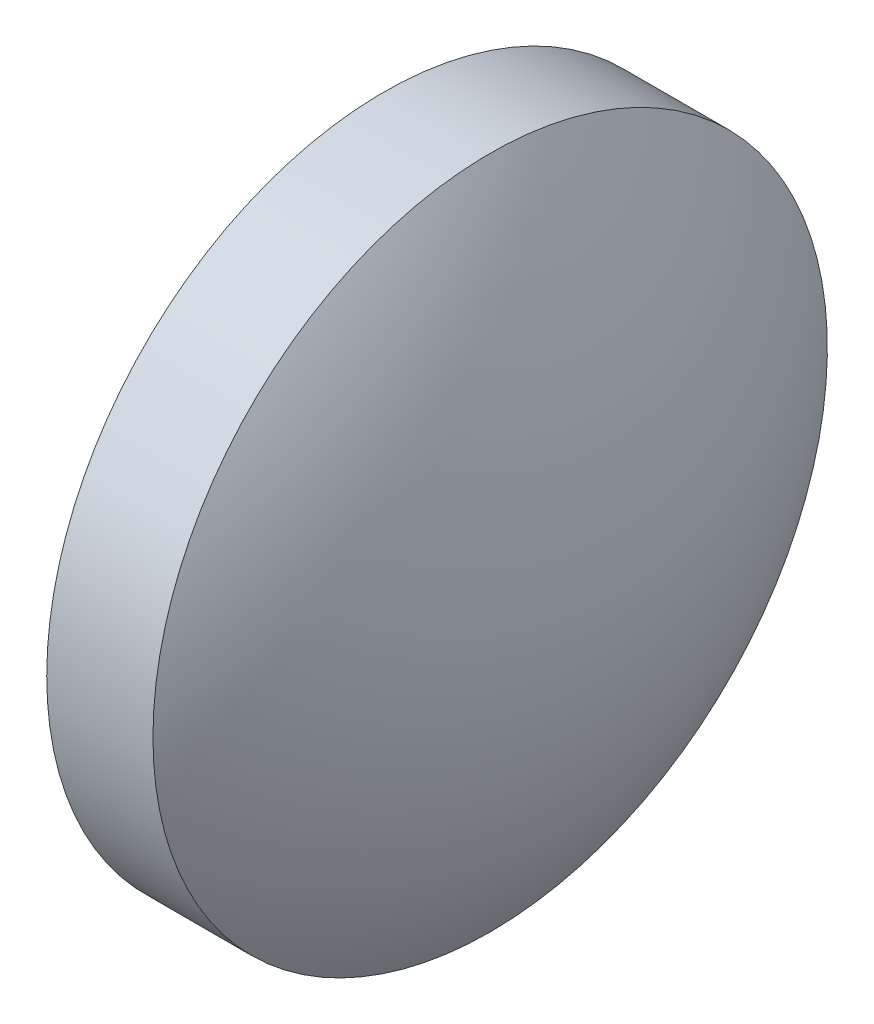
ISO-10303-21;
HEADER;
FILE_DESCRIPTION(('STEP AP214'),'2;1');
FILE_NAME('part.step','',(''),(''),'','','');
FILE_SCHEMA(('AUTOMOTIVE_DESIGN { 1 0 10303 214 1 1 1 1 }'));
ENDSEC;
DATA;
#1=APPLICATION_CONTEXT('core data for automotive mechanical design processes');
#2=APPLICATION_PROTOCOL_DEFINITION('international standard','automotive_design',2000,#1);
#3=PRODUCT_CONTEXT('',#1,'mechanical');
#4=PRODUCT('Part','Part','',(#3));
#5=PRODUCT_RELATED_PRODUCT_CATEGORY('part','',(#4));
#6=PRODUCT_DEFINITION_FORMATION('','',#4);
#7=PRODUCT_DEFINITION_CONTEXT('part definition',#1,'design');
#8=PRODUCT_DEFINITION('design','',#6,#7);
#9=PRODUCT_DEFINITION_SHAPE('','',#8);
#10=(LENGTH_UNIT() NAMED_UNIT(*) SI_UNIT(.MILLI.,.METRE.));
#11=(NAMED_UNIT(*) PLANE_ANGLE_UNIT() SI_UNIT($,.RADIAN.));
#12=(NAMED_UNIT(*) SI_UNIT($,.STERADIAN.) SOLID_ANGLE_UNIT());
#13=UNCERTAINTY_MEASURE_WITH_UNIT(LENGTH_MEASURE(1.E-05),#10,'distance_accuracy_value','');
#14=(GEOMETRIC_REPRESENTATION_CONTEXT(3) GLOBAL_UNCERTAINTY_ASSIGNED_CONTEXT((#13)) GLOBAL_UNIT_ASSIGNED_CONTEXT((#10,
#11,#12)) REPRESENTATION_CONTEXT('',''));
#15=CARTESIAN_POINT('',(0.,0.,0.));
#16=DIRECTION('',(0.,0.,1.));
#17=DIRECTION('',(1.,0.,0.));
#18=AXIS2_PLACEMENT_3D('',#15,#16,#17);
#19=CARTESIAN_POINT('',(344.929184039495,-36.8604512072569,0.));
#20=DIRECTION('',(-1.,0.,0.));
#21=DIRECTION('',(0.,-1.,0.));
#22=AXIS2_PLACEMENT_3D('',#19,#20,#21);
#23=SPHERICAL_SURFACE('',#22,11.4606510416667);
#24=CARTESIAN_POINT('',(354.469835081161,-36.8604512072569,0.));
#25=DIRECTION('',(-1.,0.,0.));
#26=DIRECTION('',(0.,0.,1.));
#27=AXIS2_PLACEMENT_3D('',#24,#25,#26);
#28=CIRCLE('',#27,6.35);
#29=CARTESIAN_POINT('',(354.469835081161,-36.8604512072569,6.35));
#30=VERTEX_POINT('',#29);
#31=EDGE_CURVE('E10',#30,#30,#28,.T.);
#32=ORIENTED_EDGE('',*,*,#31,.F.);
#33=EDGE_LOOP('',(#32));
#34=FACE_BOUND('',#33,.T.);
#35=ADVANCED_FACE('F35',(#34),#23,.T.);
#36=CARTESIAN_POINT('',(350.141806591167,-36.8604512072569,0.));
#37=DIRECTION('',(-1.,0.,0.));
#38=DIRECTION('',(0.,0.,1.));
#39=AXIS2_PLACEMENT_3D('',#36,#37,#38);
#40=CYLINDRICAL_SURFACE('',#39,6.35);
#41=CARTESIAN_POINT('',(352.469835081161,-36.8604512072569,0.));
#42=DIRECTION('',(-1.,0.,0.));
#43=DIRECTION('',(0.,0.,1.));
#44=AXIS2_PLACEMENT_3D('',#41,#42,#43);
#45=CIRCLE('',#44,6.35);
#46=CARTESIAN_POINT('',(352.469835081161,-36.8604512072569,6.35));
#47=VERTEX_POINT('',#46);
#48=EDGE_CURVE('E41',#47,#47,#45,.T.);
#49=ORIENTED_EDGE('',*,*,#48,.F.);
#50=EDGE_LOOP('',(#49));
#51=FACE_BOUND('',#50,.T.);
#52=ORIENTED_EDGE('',*,*,#31,.T.);
#53=EDGE_LOOP('',(#52));
#54=FACE_BOUND('',#53,.T.);
#55=ADVANCED_FACE('F49',(#51,#54),#40,.T.);
#56=CARTESIAN_POINT('',(352.469835081161,-36.8604512072569,0.));
#57=DIRECTION('',(1.,0.,0.));
#58=DIRECTION('',(0.,0.,-1.));
#59=AXIS2_PLACEMENT_3D('',#56,#57,#58);
#60=PLANE('',#59);
#61=ORIENTED_EDGE('',*,*,#48,.T.);
#62=EDGE_LOOP('',(#61));
#63=FACE_BOUND('',#62,.T.);
#64=ADVANCED_FACE('F47',(#63),#60,.F.);
#65=CLOSED_SHELL('',(#35,#55,#64));
#66=MANIFOLD_SOLID_BREP('B2',#65);
#67=ADVANCED_BREP_SHAPE_REPRESENTATION('',(#18,#66),#14);
#68=SHAPE_DEFINITION_REPRESENTATION(#9,#67);
ENDSEC;
END-ISO-10303-21;
